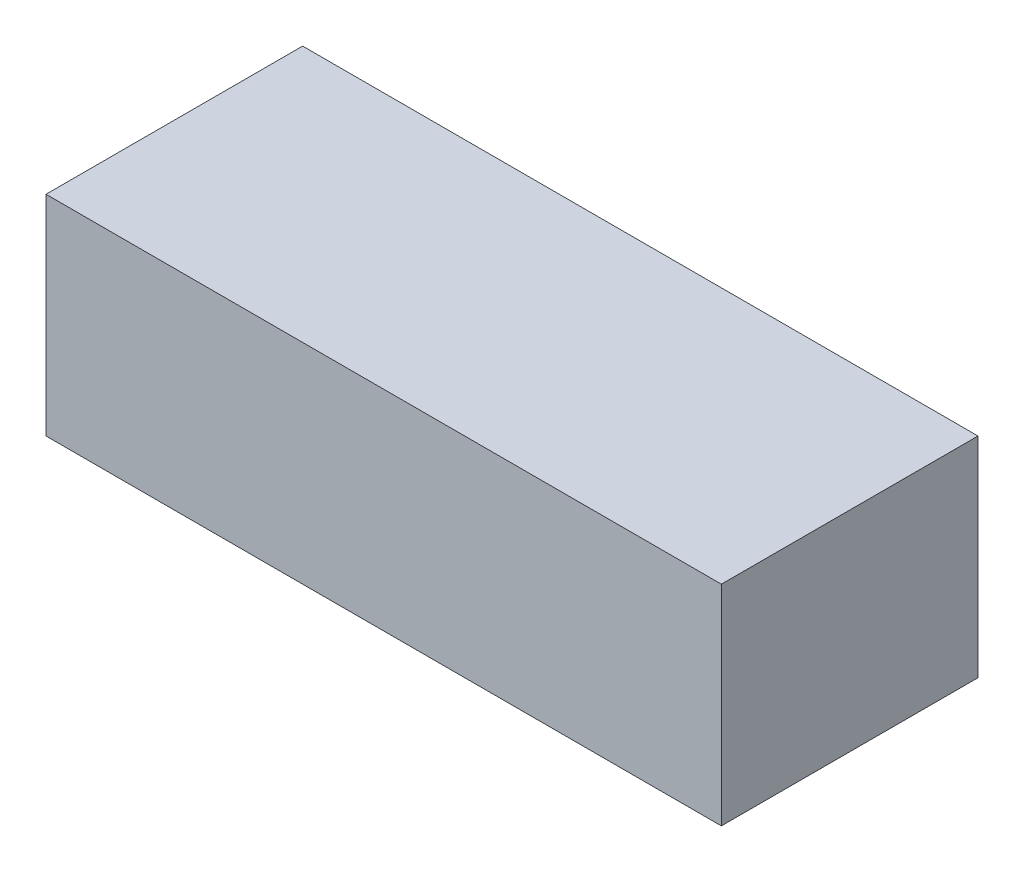
ISO-10303-21;
HEADER;
FILE_DESCRIPTION(('STEP AP214'),'2;1');
FILE_NAME('part.step','',(''),(''),'','','');
FILE_SCHEMA(('AUTOMOTIVE_DESIGN { 1 0 10303 214 1 1 1 1 }'));
ENDSEC;
DATA;
#1=APPLICATION_CONTEXT('core data for automotive mechanical design processes');
#2=APPLICATION_PROTOCOL_DEFINITION('international standard','automotive_design',2000,#1);
#3=PRODUCT_CONTEXT('',#1,'mechanical');
#4=PRODUCT('Part','Part','',(#3));
#5=PRODUCT_RELATED_PRODUCT_CATEGORY('part','',(#4));
#6=PRODUCT_DEFINITION_FORMATION('','',#4);
#7=PRODUCT_DEFINITION_CONTEXT('part definition',#1,'design');
#8=PRODUCT_DEFINITION('design','',#6,#7);
#9=PRODUCT_DEFINITION_SHAPE('','',#8);
#10=(LENGTH_UNIT() NAMED_UNIT(*) SI_UNIT(.MILLI.,.METRE.));
#11=(NAMED_UNIT(*) PLANE_ANGLE_UNIT() SI_UNIT($,.RADIAN.));
#12=(NAMED_UNIT(*) SI_UNIT($,.STERADIAN.) SOLID_ANGLE_UNIT());
#13=UNCERTAINTY_MEASURE_WITH_UNIT(LENGTH_MEASURE(1.E-05),#10,'distance_accuracy_value','');
#14=(GEOMETRIC_REPRESENTATION_CONTEXT(3) GLOBAL_UNCERTAINTY_ASSIGNED_CONTEXT((#13)) GLOBAL_UNIT_ASSIGNED_CONTEXT((#10,
#11,#12)) REPRESENTATION_CONTEXT('',''));
#15=CARTESIAN_POINT('',(0.,0.,0.));
#16=DIRECTION('',(0.,0.,1.));
#17=DIRECTION('',(1.,0.,0.));
#18=AXIS2_PLACEMENT_3D('',#15,#16,#17);
#19=CARTESIAN_POINT('',(0.,62.,0.));
#20=DIRECTION('',(1.,0.,0.));
#21=DIRECTION('',(0.,0.,-1.));
#22=AXIS2_PLACEMENT_3D('',#19,#20,#21);
#23=PLANE('',#22);
#24=DIRECTION('',(0.,0.,1.));
#25=VECTOR('',#24,1.);
#26=CARTESIAN_POINT('',(0.,0.,0.));
#27=LINE('',#26,#25);
#28=CARTESIAN_POINT('',(0.,0.,-76.));
#29=VERTEX_POINT('',#28);
#30=CARTESIAN_POINT('',(0.,0.,0.));
#31=VERTEX_POINT('',#30);
#32=EDGE_CURVE('E106',#29,#31,#27,.T.);
#33=ORIENTED_EDGE('',*,*,#32,.T.);
#34=DIRECTION('',(0.,-1.,0.));
#35=VECTOR('',#34,1.);
#36=CARTESIAN_POINT('',(0.,62.,0.));
#37=LINE('',#36,#35);
#38=CARTESIAN_POINT('',(0.,62.,0.));
#39=VERTEX_POINT('',#38);
#40=EDGE_CURVE('E11',#39,#31,#37,.T.);
#41=ORIENTED_EDGE('',*,*,#40,.F.);
#42=DIRECTION('',(0.,0.,1.));
#43=VECTOR('',#42,1.);
#44=CARTESIAN_POINT('',(0.,62.,0.));
#45=LINE('',#44,#43);
#46=CARTESIAN_POINT('',(0.,62.,-76.));
#47=VERTEX_POINT('',#46);
#48=EDGE_CURVE('E94',#47,#39,#45,.T.);
#49=ORIENTED_EDGE('',*,*,#48,.F.);
#50=DIRECTION('',(0.,-1.,0.));
#51=VECTOR('',#50,1.);
#52=CARTESIAN_POINT('',(0.,62.,-76.));
#53=LINE('',#52,#51);
#54=EDGE_CURVE('E102',#47,#29,#53,.T.);
#55=ORIENTED_EDGE('',*,*,#54,.T.);
#56=EDGE_LOOP('',(#33,#41,#49,#55));
#57=FACE_BOUND('',#56,.T.);
#58=ADVANCED_FACE('F43',(#57),#23,.F.);
#59=CARTESIAN_POINT('',(0.,62.,0.));
#60=DIRECTION('',(0.,0.,-1.));
#61=DIRECTION('',(-1.,0.,0.));
#62=AXIS2_PLACEMENT_3D('',#59,#60,#61);
#63=PLANE('',#62);
#64=DIRECTION('',(1.,0.,0.));
#65=VECTOR('',#64,1.);
#66=CARTESIAN_POINT('',(0.,0.,0.));
#67=LINE('',#66,#65);
#68=CARTESIAN_POINT('',(200.,0.,0.));
#69=VERTEX_POINT('',#68);
#70=EDGE_CURVE('E98',#31,#69,#67,.T.);
#71=ORIENTED_EDGE('',*,*,#70,.T.);
#72=DIRECTION('',(0.,-1.,0.));
#73=VECTOR('',#72,1.);
#74=CARTESIAN_POINT('',(200.,62.,0.));
#75=LINE('',#74,#73);
#76=CARTESIAN_POINT('',(200.,62.,0.));
#77=VERTEX_POINT('',#76);
#78=EDGE_CURVE('E51',#77,#69,#75,.T.);
#79=ORIENTED_EDGE('',*,*,#78,.F.);
#80=DIRECTION('',(1.,0.,0.));
#81=VECTOR('',#80,1.);
#82=CARTESIAN_POINT('',(0.,62.,0.));
#83=LINE('',#82,#81);
#84=EDGE_CURVE('E89',#39,#77,#83,.T.);
#85=ORIENTED_EDGE('',*,*,#84,.F.);
#86=ORIENTED_EDGE('',*,*,#40,.T.);
#87=EDGE_LOOP('',(#71,#79,#85,#86));
#88=FACE_BOUND('',#87,.T.);
#89=ADVANCED_FACE('F97',(#88),#63,.F.);
#90=CARTESIAN_POINT('',(200.,62.,0.));
#91=DIRECTION('',(-1.,0.,0.));
#92=DIRECTION('',(0.,0.,1.));
#93=AXIS2_PLACEMENT_3D('',#90,#91,#92);
#94=PLANE('',#93);
#95=DIRECTION('',(0.,0.,-1.));
#96=VECTOR('',#95,1.);
#97=CARTESIAN_POINT('',(200.,0.,0.));
#98=LINE('',#97,#96);
#99=CARTESIAN_POINT('',(200.,0.,-76.));
#100=VERTEX_POINT('',#99);
#101=EDGE_CURVE('E76',#69,#100,#98,.T.);
#102=ORIENTED_EDGE('',*,*,#101,.T.);
#103=DIRECTION('',(0.,-1.,0.));
#104=VECTOR('',#103,1.);
#105=CARTESIAN_POINT('',(200.,62.,-76.));
#106=LINE('',#105,#104);
#107=CARTESIAN_POINT('',(200.,62.,-76.));
#108=VERTEX_POINT('',#107);
#109=EDGE_CURVE('E99',#108,#100,#106,.T.);
#110=ORIENTED_EDGE('',*,*,#109,.F.);
#111=DIRECTION('',(0.,0.,-1.));
#112=VECTOR('',#111,1.);
#113=CARTESIAN_POINT('',(200.,62.,0.));
#114=LINE('',#113,#112);
#115=EDGE_CURVE('E92',#77,#108,#114,.T.);
#116=ORIENTED_EDGE('',*,*,#115,.F.);
#117=ORIENTED_EDGE('',*,*,#78,.T.);
#118=EDGE_LOOP('',(#102,#110,#116,#117));
#119=FACE_BOUND('',#118,.T.);
#120=ADVANCED_FACE('F100',(#119),#94,.F.);
#121=CARTESIAN_POINT('',(0.,62.,-76.));
#122=DIRECTION('',(0.,0.,1.));
#123=DIRECTION('',(1.,0.,0.));
#124=AXIS2_PLACEMENT_3D('',#121,#122,#123);
#125=PLANE('',#124);
#126=DIRECTION('',(-1.,0.,0.));
#127=VECTOR('',#126,1.);
#128=CARTESIAN_POINT('',(0.,0.,-76.));
#129=LINE('',#128,#127);
#130=EDGE_CURVE('E82',#100,#29,#129,.T.);
#131=ORIENTED_EDGE('',*,*,#130,.T.);
#132=ORIENTED_EDGE('',*,*,#54,.F.);
#133=DIRECTION('',(-1.,0.,0.));
#134=VECTOR('',#133,1.);
#135=CARTESIAN_POINT('',(0.,62.,-76.));
#136=LINE('',#135,#134);
#137=EDGE_CURVE('E59',#108,#47,#136,.T.);
#138=ORIENTED_EDGE('',*,*,#137,.F.);
#139=ORIENTED_EDGE('',*,*,#109,.T.);
#140=EDGE_LOOP('',(#131,#132,#138,#139));
#141=FACE_BOUND('',#140,.T.);
#142=ADVANCED_FACE('F113',(#141),#125,.F.);
#143=CARTESIAN_POINT('',(0.,62.,0.));
#144=DIRECTION('',(0.,-1.,0.));
#145=DIRECTION('',(0.,0.,-1.));
#146=AXIS2_PLACEMENT_3D('',#143,#144,#145);
#147=PLANE('',#146);
#148=ORIENTED_EDGE('',*,*,#48,.T.);
#149=ORIENTED_EDGE('',*,*,#84,.T.);
#150=ORIENTED_EDGE('',*,*,#115,.T.);
#151=ORIENTED_EDGE('',*,*,#137,.T.);
#152=EDGE_LOOP('',(#148,#149,#150,#151));
#153=FACE_BOUND('',#152,.T.);
#154=ADVANCED_FACE('F90',(#153),#147,.F.);
#155=CARTESIAN_POINT('',(0.,0.,0.));
#156=DIRECTION('',(0.,-1.,0.));
#157=DIRECTION('',(0.,0.,-1.));
#158=AXIS2_PLACEMENT_3D('',#155,#156,#157);
#159=PLANE('',#158);
#160=ORIENTED_EDGE('',*,*,#32,.F.);
#161=ORIENTED_EDGE('',*,*,#130,.F.);
#162=ORIENTED_EDGE('',*,*,#101,.F.);
#163=ORIENTED_EDGE('',*,*,#70,.F.);
#164=EDGE_LOOP('',(#160,#161,#162,#163));
#165=FACE_BOUND('',#164,.T.);
#166=ADVANCED_FACE('F116',(#165),#159,.T.);
#167=CLOSED_SHELL('',(#58,#89,#120,#142,#154,#166));
#168=MANIFOLD_SOLID_BREP('B2',#167);
#169=ADVANCED_BREP_SHAPE_REPRESENTATION('',(#18,#168),#14);
#170=SHAPE_DEFINITION_REPRESENTATION(#9,#169);
ENDSEC;
END-ISO-10303-21;
